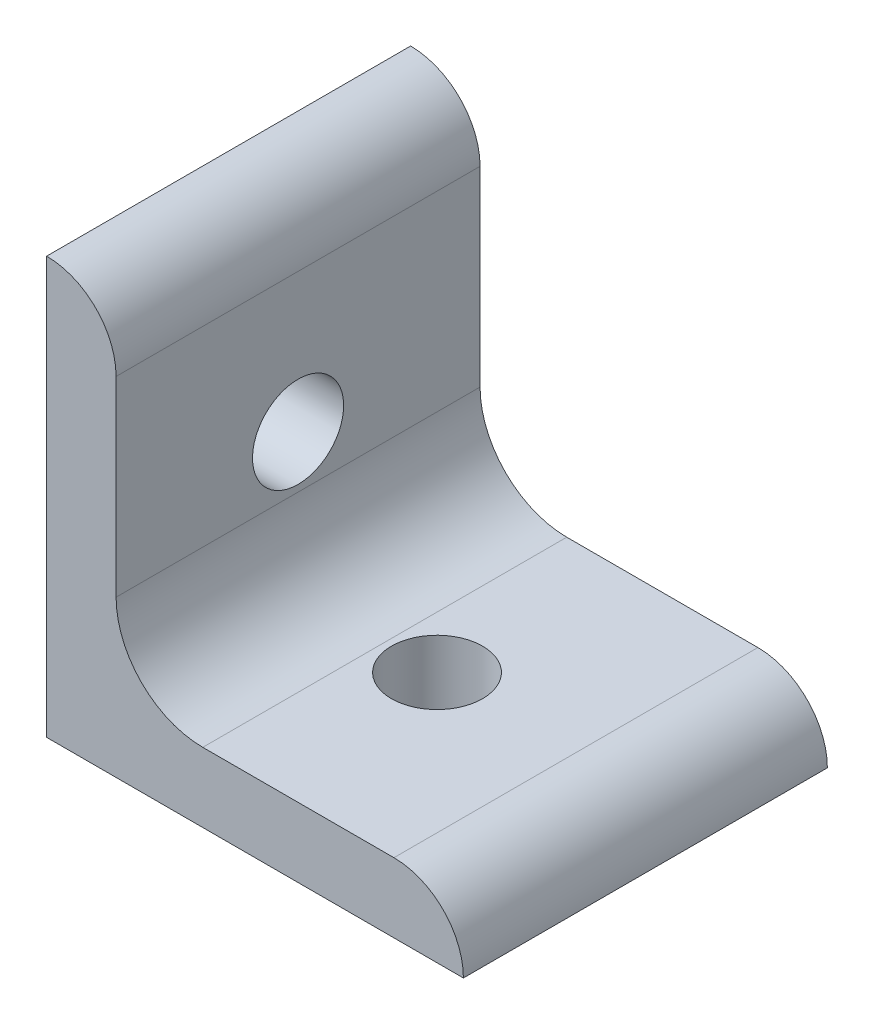
ISO-10303-21;
HEADER;
FILE_DESCRIPTION(('STEP AP214'),'2;1');
FILE_NAME('part.step','',(''),(''),'','','');
FILE_SCHEMA(('AUTOMOTIVE_DESIGN { 1 0 10303 214 1 1 1 1 }'));
ENDSEC;
DATA;
#1=APPLICATION_CONTEXT('core data for automotive mechanical design processes');
#2=APPLICATION_PROTOCOL_DEFINITION('international standard','automotive_design',2000,#1);
#3=PRODUCT_CONTEXT('',#1,'mechanical');
#4=PRODUCT('Part','Part','',(#3));
#5=PRODUCT_RELATED_PRODUCT_CATEGORY('part','',(#4));
#6=PRODUCT_DEFINITION_FORMATION('','',#4);
#7=PRODUCT_DEFINITION_CONTEXT('part definition',#1,'design');
#8=PRODUCT_DEFINITION('design','',#6,#7);
#9=PRODUCT_DEFINITION_SHAPE('','',#8);
#10=(LENGTH_UNIT() NAMED_UNIT(*) SI_UNIT(.MILLI.,.METRE.));
#11=(NAMED_UNIT(*) PLANE_ANGLE_UNIT() SI_UNIT($,.RADIAN.));
#12=(NAMED_UNIT(*) SI_UNIT($,.STERADIAN.) SOLID_ANGLE_UNIT());
#13=UNCERTAINTY_MEASURE_WITH_UNIT(LENGTH_MEASURE(1.E-05),#10,'distance_accuracy_value','');
#14=(GEOMETRIC_REPRESENTATION_CONTEXT(3) GLOBAL_UNCERTAINTY_ASSIGNED_CONTEXT((#13)) GLOBAL_UNIT_ASSIGNED_CONTEXT((#10,
#11,#12)) REPRESENTATION_CONTEXT('',''));
#15=CARTESIAN_POINT('',(0.,0.,0.));
#16=DIRECTION('',(0.,0.,1.));
#17=DIRECTION('',(1.,0.,0.));
#18=AXIS2_PLACEMENT_3D('',#15,#16,#17);
#19=CARTESIAN_POINT('',(38.1,0.,16.637));
#20=DIRECTION('',(0.,1.,0.));
#21=DIRECTION('',(-1.,0.,0.));
#22=AXIS2_PLACEMENT_3D('',#19,#20,#21);
#23=PLANE('',#22);
#24=CARTESIAN_POINT('',(19.05,0.,0.));
#25=DIRECTION('',(0.,-1.,0.));
#26=DIRECTION('',(1.,0.,0.));
#27=AXIS2_PLACEMENT_3D('',#24,#25,#26);
#28=CIRCLE('',#27,4.1656);
#29=CARTESIAN_POINT('',(23.2156,0.,0.));
#30=VERTEX_POINT('',#29);
#31=EDGE_CURVE('E149',#30,#30,#28,.T.);
#32=ORIENTED_EDGE('',*,*,#31,.F.);
#33=EDGE_LOOP('',(#32));
#34=FACE_BOUND('',#33,.T.);
#35=DIRECTION('',(1.,0.,0.));
#36=VECTOR('',#35,1.);
#37=CARTESIAN_POINT('',(38.1,0.,-16.637));
#38=LINE('',#37,#36);
#39=CARTESIAN_POINT('',(0.,0.,-16.637));
#40=VERTEX_POINT('',#39);
#41=CARTESIAN_POINT('',(38.1,0.,-16.637));
#42=VERTEX_POINT('',#41);
#43=EDGE_CURVE('E107',#40,#42,#38,.T.);
#44=ORIENTED_EDGE('',*,*,#43,.T.);
#45=DIRECTION('',(0.,0.,-1.));
#46=VECTOR('',#45,1.);
#47=CARTESIAN_POINT('',(38.1,0.,16.637));
#48=LINE('',#47,#46);
#49=CARTESIAN_POINT('',(38.1,0.,16.637));
#50=VERTEX_POINT('',#49);
#51=EDGE_CURVE('E105',#50,#42,#48,.T.);
#52=ORIENTED_EDGE('',*,*,#51,.F.);
#53=DIRECTION('',(1.,0.,0.));
#54=VECTOR('',#53,1.);
#55=CARTESIAN_POINT('',(38.1,0.,16.637));
#56=LINE('',#55,#54);
#57=CARTESIAN_POINT('',(0.,0.,16.637));
#58=VERTEX_POINT('',#57);
#59=EDGE_CURVE('E90',#58,#50,#56,.T.);
#60=ORIENTED_EDGE('',*,*,#59,.F.);
#61=DIRECTION('',(0.,0.,-1.));
#62=VECTOR('',#61,1.);
#63=CARTESIAN_POINT('',(0.,0.,16.637));
#64=LINE('',#63,#62);
#65=EDGE_CURVE('E130',#58,#40,#64,.T.);
#66=ORIENTED_EDGE('',*,*,#65,.T.);
#67=EDGE_LOOP('',(#44,#52,#60,#66));
#68=FACE_BOUND('',#67,.T.);
#69=ADVANCED_FACE('F32',(#34,#68),#23,.F.);
#70=CARTESIAN_POINT('',(14.2748,6.35,16.637));
#71=DIRECTION('',(0.,-1.,0.));
#72=DIRECTION('',(1.,0.,0.));
#73=AXIS2_PLACEMENT_3D('',#70,#71,#72);
#74=PLANE('',#73);
#75=CARTESIAN_POINT('',(19.05,6.35,0.));
#76=DIRECTION('',(0.,-1.,0.));
#77=DIRECTION('',(1.,0.,0.));
#78=AXIS2_PLACEMENT_3D('',#75,#76,#77);
#79=CIRCLE('',#78,4.1656);
#80=CARTESIAN_POINT('',(23.2156,6.35,0.));
#81=VERTEX_POINT('',#80);
#82=EDGE_CURVE('E140',#81,#81,#79,.F.);
#83=ORIENTED_EDGE('',*,*,#82,.F.);
#84=EDGE_LOOP('',(#83));
#85=FACE_BOUND('',#84,.T.);
#86=DIRECTION('',(-1.,0.,0.));
#87=VECTOR('',#86,1.);
#88=CARTESIAN_POINT('',(14.2748,6.35,16.637));
#89=LINE('',#88,#87);
#90=CARTESIAN_POINT('',(31.75,6.35,16.637));
#91=VERTEX_POINT('',#90);
#92=CARTESIAN_POINT('',(14.2748,6.35,16.637));
#93=VERTEX_POINT('',#92);
#94=EDGE_CURVE('E100',#91,#93,#89,.T.);
#95=ORIENTED_EDGE('',*,*,#94,.F.);
#96=DIRECTION('',(0.,0.,-1.));
#97=VECTOR('',#96,1.);
#98=CARTESIAN_POINT('',(31.75,6.35,16.637));
#99=LINE('',#98,#97);
#100=CARTESIAN_POINT('',(31.75,6.35,-16.637));
#101=VERTEX_POINT('',#100);
#102=EDGE_CURVE('E109',#91,#101,#99,.T.);
#103=ORIENTED_EDGE('',*,*,#102,.T.);
#104=DIRECTION('',(-1.,0.,0.));
#105=VECTOR('',#104,1.);
#106=CARTESIAN_POINT('',(14.2748,6.35,-16.637));
#107=LINE('',#106,#105);
#108=CARTESIAN_POINT('',(14.2748,6.35,-16.637));
#109=VERTEX_POINT('',#108);
#110=EDGE_CURVE('E137',#101,#109,#107,.T.);
#111=ORIENTED_EDGE('',*,*,#110,.T.);
#112=DIRECTION('',(0.,0.,-1.));
#113=VECTOR('',#112,1.);
#114=CARTESIAN_POINT('',(14.2748,6.35,16.637));
#115=LINE('',#114,#113);
#116=EDGE_CURVE('E110',#93,#109,#115,.T.);
#117=ORIENTED_EDGE('',*,*,#116,.F.);
#118=EDGE_LOOP('',(#95,#103,#111,#117));
#119=FACE_BOUND('',#118,.T.);
#120=ADVANCED_FACE('F172',(#85,#119),#74,.F.);
#121=CARTESIAN_POINT('',(14.2748,14.2748,16.637));
#122=DIRECTION('',(0.,0.,-1.));
#123=DIRECTION('',(-1.,0.,0.));
#124=AXIS2_PLACEMENT_3D('',#121,#122,#123);
#125=CYLINDRICAL_SURFACE('',#124,7.9248);
#126=CARTESIAN_POINT('',(14.2748,14.2748,-16.637));
#127=DIRECTION('',(0.,0.,-1.));
#128=DIRECTION('',(1.,0.,0.));
#129=AXIS2_PLACEMENT_3D('',#126,#127,#128);
#130=CIRCLE('',#129,7.9248);
#131=CARTESIAN_POINT('',(6.34999999999999,14.2748,-16.637));
#132=VERTEX_POINT('',#131);
#133=EDGE_CURVE('E135',#109,#132,#130,.T.);
#134=ORIENTED_EDGE('',*,*,#133,.T.);
#135=DIRECTION('',(0.,0.,-1.));
#136=VECTOR('',#135,1.);
#137=CARTESIAN_POINT('',(6.34999999999999,14.2748,16.637));
#138=LINE('',#137,#136);
#139=CARTESIAN_POINT('',(6.34999999999999,14.2748,16.637));
#140=VERTEX_POINT('',#139);
#141=EDGE_CURVE('E124',#140,#132,#138,.T.);
#142=ORIENTED_EDGE('',*,*,#141,.F.);
#143=CARTESIAN_POINT('',(14.2748,14.2748,16.637));
#144=DIRECTION('',(0.,0.,-1.));
#145=DIRECTION('',(1.,0.,0.));
#146=AXIS2_PLACEMENT_3D('',#143,#144,#145);
#147=CIRCLE('',#146,7.9248);
#148=EDGE_CURVE('E144',#93,#140,#147,.T.);
#149=ORIENTED_EDGE('',*,*,#148,.F.);
#150=ORIENTED_EDGE('',*,*,#116,.T.);
#151=EDGE_LOOP('',(#134,#142,#149,#150));
#152=FACE_BOUND('',#151,.T.);
#153=ADVANCED_FACE('F178',(#152),#125,.F.);
#154=CARTESIAN_POINT('',(6.34999999999999,38.1,16.637));
#155=DIRECTION('',(-1.,0.,0.));
#156=DIRECTION('',(0.,-1.,0.));
#157=AXIS2_PLACEMENT_3D('',#154,#155,#156);
#158=PLANE('',#157);
#159=CARTESIAN_POINT('',(6.34999999999999,19.05,0.));
#160=DIRECTION('',(-1.,0.,0.));
#161=DIRECTION('',(0.,-1.,0.));
#162=AXIS2_PLACEMENT_3D('',#159,#160,#161);
#163=CIRCLE('',#162,4.1656);
#164=CARTESIAN_POINT('',(6.35,14.8844,0.));
#165=VERTEX_POINT('',#164);
#166=EDGE_CURVE('E152',#165,#165,#163,.F.);
#167=ORIENTED_EDGE('',*,*,#166,.F.);
#168=EDGE_LOOP('',(#167));
#169=FACE_BOUND('',#168,.T.);
#170=DIRECTION('',(0.,1.,0.));
#171=VECTOR('',#170,1.);
#172=CARTESIAN_POINT('',(6.34999999999999,38.1,-16.637));
#173=LINE('',#172,#171);
#174=CARTESIAN_POINT('',(6.34999999999999,31.75,-16.637));
#175=VERTEX_POINT('',#174);
#176=EDGE_CURVE('E133',#132,#175,#173,.T.);
#177=ORIENTED_EDGE('',*,*,#176,.T.);
#178=DIRECTION('',(0.,0.,-1.));
#179=VECTOR('',#178,1.);
#180=CARTESIAN_POINT('',(6.34999999999999,31.75,16.637));
#181=LINE('',#180,#179);
#182=CARTESIAN_POINT('',(6.34999999999999,31.75,16.637));
#183=VERTEX_POINT('',#182);
#184=EDGE_CURVE('E11',#175,#183,#181,.F.);
#185=ORIENTED_EDGE('',*,*,#184,.T.);
#186=DIRECTION('',(0.,1.,0.));
#187=VECTOR('',#186,1.);
#188=CARTESIAN_POINT('',(6.34999999999999,38.1,16.637));
#189=LINE('',#188,#187);
#190=EDGE_CURVE('E142',#140,#183,#189,.T.);
#191=ORIENTED_EDGE('',*,*,#190,.F.);
#192=ORIENTED_EDGE('',*,*,#141,.T.);
#193=EDGE_LOOP('',(#177,#185,#191,#192));
#194=FACE_BOUND('',#193,.T.);
#195=ADVANCED_FACE('F165',(#169,#194),#158,.F.);
#196=CARTESIAN_POINT('',(0.,0.,16.637));
#197=DIRECTION('',(1.,0.,0.));
#198=DIRECTION('',(0.,1.,0.));
#199=AXIS2_PLACEMENT_3D('',#196,#197,#198);
#200=PLANE('',#199);
#201=CARTESIAN_POINT('',(0.,19.05,0.));
#202=DIRECTION('',(-1.,0.,0.));
#203=DIRECTION('',(0.,-1.,0.));
#204=AXIS2_PLACEMENT_3D('',#201,#202,#203);
#205=CIRCLE('',#204,4.1656);
#206=CARTESIAN_POINT('',(0.,14.8844,0.));
#207=VERTEX_POINT('',#206);
#208=EDGE_CURVE('E155',#207,#207,#205,.T.);
#209=ORIENTED_EDGE('',*,*,#208,.F.);
#210=EDGE_LOOP('',(#209));
#211=FACE_BOUND('',#210,.T.);
#212=DIRECTION('',(0.,-1.,0.));
#213=VECTOR('',#212,1.);
#214=CARTESIAN_POINT('',(0.,0.,-16.637));
#215=LINE('',#214,#213);
#216=CARTESIAN_POINT('',(0.,38.1,-16.637));
#217=VERTEX_POINT('',#216);
#218=EDGE_CURVE('E101',#217,#40,#215,.T.);
#219=ORIENTED_EDGE('',*,*,#218,.T.);
#220=ORIENTED_EDGE('',*,*,#65,.F.);
#221=DIRECTION('',(0.,-1.,0.));
#222=VECTOR('',#221,1.);
#223=CARTESIAN_POINT('',(0.,0.,16.637));
#224=LINE('',#223,#222);
#225=CARTESIAN_POINT('',(0.,38.1,16.637));
#226=VERTEX_POINT('',#225);
#227=EDGE_CURVE('E96',#226,#58,#224,.T.);
#228=ORIENTED_EDGE('',*,*,#227,.F.);
#229=DIRECTION('',(0.,0.,-1.));
#230=VECTOR('',#229,1.);
#231=CARTESIAN_POINT('',(0.,38.1,16.637));
#232=LINE('',#231,#230);
#233=EDGE_CURVE('E127',#226,#217,#232,.T.);
#234=ORIENTED_EDGE('',*,*,#233,.T.);
#235=EDGE_LOOP('',(#219,#220,#228,#234));
#236=FACE_BOUND('',#235,.T.);
#237=ADVANCED_FACE('F162',(#211,#236),#200,.F.);
#238=CARTESIAN_POINT('',(14.2748,14.2748,16.637));
#239=DIRECTION('',(0.,0.,1.));
#240=DIRECTION('',(1.,0.,0.));
#241=AXIS2_PLACEMENT_3D('',#238,#239,#240);
#242=PLANE('',#241);
#243=ORIENTED_EDGE('',*,*,#59,.T.);
#244=CARTESIAN_POINT('',(31.75,0.,16.637));
#245=DIRECTION('',(0.,0.,1.));
#246=DIRECTION('',(1.,0.,0.));
#247=AXIS2_PLACEMENT_3D('',#244,#245,#246);
#248=CIRCLE('',#247,6.35);
#249=EDGE_CURVE('E40',#50,#91,#248,.T.);
#250=ORIENTED_EDGE('',*,*,#249,.T.);
#251=ORIENTED_EDGE('',*,*,#94,.T.);
#252=ORIENTED_EDGE('',*,*,#148,.T.);
#253=ORIENTED_EDGE('',*,*,#190,.T.);
#254=CARTESIAN_POINT('',(0.,31.75,16.637));
#255=DIRECTION('',(0.,0.,1.));
#256=DIRECTION('',(1.,0.,0.));
#257=AXIS2_PLACEMENT_3D('',#254,#255,#256);
#258=CIRCLE('',#257,6.35);
#259=EDGE_CURVE('E115',#183,#226,#258,.T.);
#260=ORIENTED_EDGE('',*,*,#259,.T.);
#261=ORIENTED_EDGE('',*,*,#227,.T.);
#262=EDGE_LOOP('',(#243,#250,#251,#252,#253,#260,#261));
#263=FACE_BOUND('',#262,.T.);
#264=ADVANCED_FACE('F92',(#263),#242,.T.);
#265=CARTESIAN_POINT('',(14.2748,14.2748,-16.637));
#266=DIRECTION('',(0.,0.,1.));
#267=DIRECTION('',(1.,0.,0.));
#268=AXIS2_PLACEMENT_3D('',#265,#266,#267);
#269=PLANE('',#268);
#270=ORIENTED_EDGE('',*,*,#110,.F.);
#271=CARTESIAN_POINT('',(31.75,0.,-16.637));
#272=DIRECTION('',(0.,0.,1.));
#273=DIRECTION('',(1.,0.,0.));
#274=AXIS2_PLACEMENT_3D('',#271,#272,#273);
#275=CIRCLE('',#274,6.35);
#276=EDGE_CURVE('E116',#101,#42,#275,.F.);
#277=ORIENTED_EDGE('',*,*,#276,.T.);
#278=ORIENTED_EDGE('',*,*,#43,.F.);
#279=ORIENTED_EDGE('',*,*,#218,.F.);
#280=CARTESIAN_POINT('',(0.,31.75,-16.637));
#281=DIRECTION('',(0.,0.,1.));
#282=DIRECTION('',(1.,0.,0.));
#283=AXIS2_PLACEMENT_3D('',#280,#281,#282);
#284=CIRCLE('',#283,6.35);
#285=EDGE_CURVE('E53',#217,#175,#284,.F.);
#286=ORIENTED_EDGE('',*,*,#285,.T.);
#287=ORIENTED_EDGE('',*,*,#176,.F.);
#288=ORIENTED_EDGE('',*,*,#133,.F.);
#289=EDGE_LOOP('',(#270,#277,#278,#279,#286,#287,#288));
#290=FACE_BOUND('',#289,.T.);
#291=ADVANCED_FACE('F169',(#290),#269,.F.);
#292=CARTESIAN_POINT('',(31.75,0.,16.637));
#293=DIRECTION('',(0.,0.,-1.));
#294=DIRECTION('',(-1.,0.,0.));
#295=AXIS2_PLACEMENT_3D('',#292,#293,#294);
#296=CYLINDRICAL_SURFACE('',#295,6.35);
#297=ORIENTED_EDGE('',*,*,#249,.F.);
#298=ORIENTED_EDGE('',*,*,#51,.T.);
#299=ORIENTED_EDGE('',*,*,#276,.F.);
#300=ORIENTED_EDGE('',*,*,#102,.F.);
#301=EDGE_LOOP('',(#297,#298,#299,#300));
#302=FACE_BOUND('',#301,.T.);
#303=ADVANCED_FACE('F113',(#302),#296,.T.);
#304=CARTESIAN_POINT('',(0.,31.75,16.637));
#305=DIRECTION('',(0.,0.,-1.));
#306=DIRECTION('',(-1.,0.,0.));
#307=AXIS2_PLACEMENT_3D('',#304,#305,#306);
#308=CYLINDRICAL_SURFACE('',#307,6.35);
#309=ORIENTED_EDGE('',*,*,#259,.F.);
#310=ORIENTED_EDGE('',*,*,#184,.F.);
#311=ORIENTED_EDGE('',*,*,#285,.F.);
#312=ORIENTED_EDGE('',*,*,#233,.F.);
#313=EDGE_LOOP('',(#309,#310,#311,#312));
#314=FACE_BOUND('',#313,.T.);
#315=ADVANCED_FACE('F34',(#314),#308,.T.);
#316=CARTESIAN_POINT('',(19.05,38.101,0.));
#317=DIRECTION('',(0.,-1.,0.));
#318=DIRECTION('',(1.,0.,0.));
#319=AXIS2_PLACEMENT_3D('',#316,#317,#318);
#320=CYLINDRICAL_SURFACE('',#319,4.1656);
#321=ORIENTED_EDGE('',*,*,#31,.T.);
#322=EDGE_LOOP('',(#321));
#323=FACE_BOUND('',#322,.T.);
#324=ORIENTED_EDGE('',*,*,#82,.T.);
#325=EDGE_LOOP('',(#324));
#326=FACE_BOUND('',#325,.T.);
#327=ADVANCED_FACE('F201',(#323,#326),#320,.F.);
#328=CARTESIAN_POINT('',(38.101,19.05,0.));
#329=DIRECTION('',(-1.,0.,0.));
#330=DIRECTION('',(0.,-1.,0.));
#331=AXIS2_PLACEMENT_3D('',#328,#329,#330);
#332=CYLINDRICAL_SURFACE('',#331,4.1656);
#333=ORIENTED_EDGE('',*,*,#208,.T.);
#334=EDGE_LOOP('',(#333));
#335=FACE_BOUND('',#334,.T.);
#336=ORIENTED_EDGE('',*,*,#166,.T.);
#337=EDGE_LOOP('',(#336));
#338=FACE_BOUND('',#337,.T.);
#339=ADVANCED_FACE('F159',(#335,#338),#332,.F.);
#340=CLOSED_SHELL('',(#69,#120,#153,#195,#237,#264,#291,#303,#315,#327,#339));
#341=MANIFOLD_SOLID_BREP('B2',#340);
#342=ADVANCED_BREP_SHAPE_REPRESENTATION('',(#18,#341),#14);
#343=SHAPE_DEFINITION_REPRESENTATION(#9,#342);
ENDSEC;
END-ISO-10303-21;
